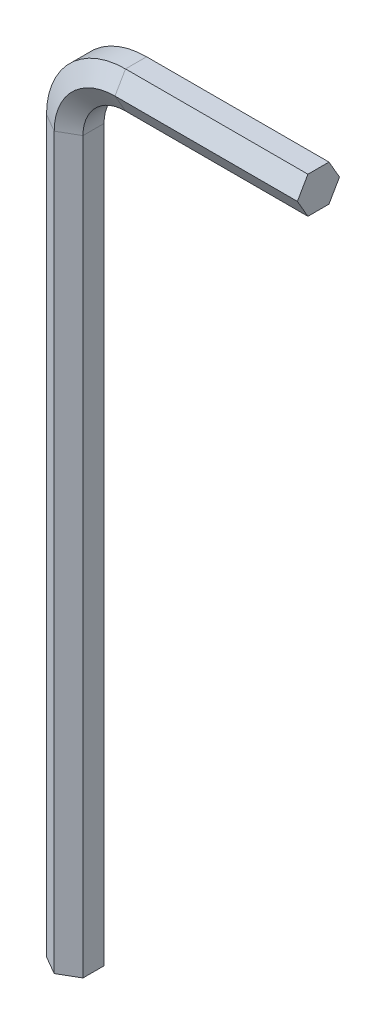
ISO-10303-21;
HEADER;
FILE_DESCRIPTION(('STEP AP214'),'2;1');
FILE_NAME('part.step','',(''),(''),'','','');
FILE_SCHEMA(('AUTOMOTIVE_DESIGN { 1 0 10303 214 1 1 1 1 }'));
ENDSEC;
DATA;
#1=APPLICATION_CONTEXT('core data for automotive mechanical design processes');
#2=APPLICATION_PROTOCOL_DEFINITION('international standard','automotive_design',2000,#1);
#3=PRODUCT_CONTEXT('',#1,'mechanical');
#4=PRODUCT('Part','Part','',(#3));
#5=PRODUCT_RELATED_PRODUCT_CATEGORY('part','',(#4));
#6=PRODUCT_DEFINITION_FORMATION('','',#4);
#7=PRODUCT_DEFINITION_CONTEXT('part definition',#1,'design');
#8=PRODUCT_DEFINITION('design','',#6,#7);
#9=PRODUCT_DEFINITION_SHAPE('','',#8);
#10=(LENGTH_UNIT() NAMED_UNIT(*) SI_UNIT(.MILLI.,.METRE.));
#11=(NAMED_UNIT(*) PLANE_ANGLE_UNIT() SI_UNIT($,.RADIAN.));
#12=(NAMED_UNIT(*) SI_UNIT($,.STERADIAN.) SOLID_ANGLE_UNIT());
#13=UNCERTAINTY_MEASURE_WITH_UNIT(LENGTH_MEASURE(1.E-05),#10,'distance_accuracy_value','');
#14=(GEOMETRIC_REPRESENTATION_CONTEXT(3) GLOBAL_UNCERTAINTY_ASSIGNED_CONTEXT((#13)) GLOBAL_UNIT_ASSIGNED_CONTEXT((#10,
#11,#12)) REPRESENTATION_CONTEXT('',''));
#15=CARTESIAN_POINT('',(0.,0.,0.));
#16=DIRECTION('',(0.,0.,1.));
#17=DIRECTION('',(1.,0.,0.));
#18=AXIS2_PLACEMENT_3D('',#15,#16,#17);
#19=CARTESIAN_POINT('',(0.,0.,0.));
#20=DIRECTION('',(0.,1.,0.));
#21=DIRECTION('',(0.,0.,1.));
#22=AXIS2_PLACEMENT_3D('',#19,#20,#21);
#23=PLANE('',#22);
#24=DIRECTION('',(0.,0.,-1.));
#25=VECTOR('',#24,1.);
#26=CARTESIAN_POINT('',(1.5,0.,0.866025403784438));
#27=LINE('',#26,#25);
#28=CARTESIAN_POINT('',(1.5,0.,0.866025403784438));
#29=VERTEX_POINT('',#28);
#30=CARTESIAN_POINT('',(1.5,0.,-0.866025403784439));
#31=VERTEX_POINT('',#30);
#32=EDGE_CURVE('E184',#29,#31,#27,.T.);
#33=ORIENTED_EDGE('',*,*,#32,.F.);
#34=DIRECTION('',(0.866025403784439,0.,-0.5));
#35=VECTOR('',#34,1.);
#36=CARTESIAN_POINT('',(0.,0.,1.73205080756888));
#37=LINE('',#36,#35);
#38=CARTESIAN_POINT('',(0.,0.,1.73205080756888));
#39=VERTEX_POINT('',#38);
#40=EDGE_CURVE('E226',#39,#29,#37,.T.);
#41=ORIENTED_EDGE('',*,*,#40,.F.);
#42=DIRECTION('',(0.866025403784439,0.,0.5));
#43=VECTOR('',#42,1.);
#44=CARTESIAN_POINT('',(-1.5,0.,0.866025403784438));
#45=LINE('',#44,#43);
#46=CARTESIAN_POINT('',(-1.5,0.,0.866025403784438));
#47=VERTEX_POINT('',#46);
#48=EDGE_CURVE('E213',#47,#39,#45,.T.);
#49=ORIENTED_EDGE('',*,*,#48,.F.);
#50=DIRECTION('',(0.,0.,1.));
#51=VECTOR('',#50,1.);
#52=CARTESIAN_POINT('',(-1.5,0.,-0.866025403784439));
#53=LINE('',#52,#51);
#54=CARTESIAN_POINT('',(-1.5,0.,-0.866025403784439));
#55=VERTEX_POINT('',#54);
#56=EDGE_CURVE('E136',#55,#47,#53,.T.);
#57=ORIENTED_EDGE('',*,*,#56,.F.);
#58=DIRECTION('',(-0.866025403784439,0.,0.5));
#59=VECTOR('',#58,1.);
#60=CARTESIAN_POINT('',(0.,0.,-1.73205080756888));
#61=LINE('',#60,#59);
#62=CARTESIAN_POINT('',(0.,0.,-1.73205080756888));
#63=VERTEX_POINT('',#62);
#64=EDGE_CURVE('E140',#63,#55,#61,.T.);
#65=ORIENTED_EDGE('',*,*,#64,.F.);
#66=DIRECTION('',(-0.866025403784439,0.,-0.5));
#67=VECTOR('',#66,1.);
#68=CARTESIAN_POINT('',(1.5,0.,-0.866025403784439));
#69=LINE('',#68,#67);
#70=EDGE_CURVE('E145',#31,#63,#69,.T.);
#71=ORIENTED_EDGE('',*,*,#70,.F.);
#72=EDGE_LOOP('',(#33,#41,#49,#57,#65,#71));
#73=FACE_BOUND('',#72,.T.);
#74=ADVANCED_FACE('F35',(#73),#23,.F.);
#75=CARTESIAN_POINT('',(20.,65.,0.));
#76=DIRECTION('',(1.,0.,0.));
#77=DIRECTION('',(0.,0.,1.));
#78=AXIS2_PLACEMENT_3D('',#75,#76,#77);
#79=PLANE('',#78);
#80=DIRECTION('',(0.,0.,-1.));
#81=VECTOR('',#80,1.);
#82=CARTESIAN_POINT('',(20.,63.5,0.866025403784438));
#83=LINE('',#82,#81);
#84=CARTESIAN_POINT('',(20.,63.5,0.866025403784438));
#85=VERTEX_POINT('',#84);
#86=CARTESIAN_POINT('',(20.,63.5,-0.866025403784439));
#87=VERTEX_POINT('',#86);
#88=EDGE_CURVE('E156',#85,#87,#83,.T.);
#89=ORIENTED_EDGE('',*,*,#88,.T.);
#90=DIRECTION('',(0.,0.866025403784439,-0.5));
#91=VECTOR('',#90,1.);
#92=CARTESIAN_POINT('',(20.,63.5,-0.866025403784439));
#93=LINE('',#92,#91);
#94=CARTESIAN_POINT('',(20.,65.,-1.73205080756888));
#95=VERTEX_POINT('',#94);
#96=EDGE_CURVE('E159',#87,#95,#93,.T.);
#97=ORIENTED_EDGE('',*,*,#96,.T.);
#98=DIRECTION('',(0.,0.866025403784439,0.5));
#99=VECTOR('',#98,1.);
#100=CARTESIAN_POINT('',(20.,65.,-1.73205080756888));
#101=LINE('',#100,#99);
#102=CARTESIAN_POINT('',(20.,66.5,-0.866025403784439));
#103=VERTEX_POINT('',#102);
#104=EDGE_CURVE('E199',#95,#103,#101,.T.);
#105=ORIENTED_EDGE('',*,*,#104,.T.);
#106=DIRECTION('',(0.,0.,1.));
#107=VECTOR('',#106,1.);
#108=CARTESIAN_POINT('',(20.,66.5,-0.866025403784439));
#109=LINE('',#108,#107);
#110=CARTESIAN_POINT('',(20.,66.5,0.866025403784438));
#111=VERTEX_POINT('',#110);
#112=EDGE_CURVE('E54',#103,#111,#109,.T.);
#113=ORIENTED_EDGE('',*,*,#112,.T.);
#114=DIRECTION('',(0.,-0.866025403784439,0.5));
#115=VECTOR('',#114,1.);
#116=CARTESIAN_POINT('',(20.,66.5,0.866025403784438));
#117=LINE('',#116,#115);
#118=CARTESIAN_POINT('',(20.,65.,1.73205080756888));
#119=VERTEX_POINT('',#118);
#120=EDGE_CURVE('E48',#111,#119,#117,.T.);
#121=ORIENTED_EDGE('',*,*,#120,.T.);
#122=DIRECTION('',(0.,-0.866025403784439,-0.5));
#123=VECTOR('',#122,1.);
#124=CARTESIAN_POINT('',(20.,65.,1.73205080756888));
#125=LINE('',#124,#123);
#126=EDGE_CURVE('E11',#119,#85,#125,.T.);
#127=ORIENTED_EDGE('',*,*,#126,.T.);
#128=EDGE_LOOP('',(#89,#97,#105,#113,#121,#127));
#129=FACE_BOUND('',#128,.T.);
#130=ADVANCED_FACE('F158',(#129),#79,.T.);
#131=CARTESIAN_POINT('',(1.5,0.,0.866025403784438));
#132=DIRECTION('',(1.,0.,0.));
#133=DIRECTION('',(0.,0.,-1.));
#134=AXIS2_PLACEMENT_3D('',#131,#132,#133);
#135=PLANE('',#134);
#136=DIRECTION('',(0.,1.,0.));
#137=VECTOR('',#136,1.);
#138=CARTESIAN_POINT('',(1.5,0.,-0.866025403784439));
#139=LINE('',#138,#137);
#140=CARTESIAN_POINT('',(1.5,60.,-0.866025403784439));
#141=VERTEX_POINT('',#140);
#142=EDGE_CURVE('E189',#31,#141,#139,.T.);
#143=ORIENTED_EDGE('',*,*,#142,.T.);
#144=DIRECTION('',(0.,0.,-1.));
#145=VECTOR('',#144,1.);
#146=CARTESIAN_POINT('',(1.5,60.,0.866025403784438));
#147=LINE('',#146,#145);
#148=CARTESIAN_POINT('',(1.5,60.,0.866025403784438));
#149=VERTEX_POINT('',#148);
#150=EDGE_CURVE('E258',#149,#141,#147,.T.);
#151=ORIENTED_EDGE('',*,*,#150,.F.);
#152=DIRECTION('',(0.,1.,0.));
#153=VECTOR('',#152,1.);
#154=CARTESIAN_POINT('',(1.5,0.,0.866025403784438));
#155=LINE('',#154,#153);
#156=EDGE_CURVE('E240',#29,#149,#155,.T.);
#157=ORIENTED_EDGE('',*,*,#156,.F.);
#158=ORIENTED_EDGE('',*,*,#32,.T.);
#159=EDGE_LOOP('',(#143,#151,#157,#158));
#160=FACE_BOUND('',#159,.T.);
#161=ADVANCED_FACE('F265',(#160),#135,.T.);
#162=CARTESIAN_POINT('',(1.5,0.,-0.866025403784439));
#163=DIRECTION('',(0.5,0.,-0.866025403784439));
#164=DIRECTION('',(-0.866025403784439,0.,-0.5));
#165=AXIS2_PLACEMENT_3D('',#162,#163,#164);
#166=PLANE('',#165);
#167=DIRECTION('',(0.,1.,0.));
#168=VECTOR('',#167,1.);
#169=CARTESIAN_POINT('',(0.,0.,-1.73205080756888));
#170=LINE('',#169,#168);
#171=CARTESIAN_POINT('',(0.,60.,-1.73205080756888));
#172=VERTEX_POINT('',#171);
#173=EDGE_CURVE('E188',#63,#172,#170,.T.);
#174=ORIENTED_EDGE('',*,*,#173,.T.);
#175=DIRECTION('',(-0.866025403784439,0.,-0.5));
#176=VECTOR('',#175,1.);
#177=CARTESIAN_POINT('',(1.5,60.,-0.866025403784439));
#178=LINE('',#177,#176);
#179=EDGE_CURVE('E185',#141,#172,#178,.T.);
#180=ORIENTED_EDGE('',*,*,#179,.F.);
#181=ORIENTED_EDGE('',*,*,#142,.F.);
#182=ORIENTED_EDGE('',*,*,#70,.T.);
#183=EDGE_LOOP('',(#174,#180,#181,#182));
#184=FACE_BOUND('',#183,.T.);
#185=ADVANCED_FACE('F268',(#184),#166,.T.);
#186=CARTESIAN_POINT('',(0.,0.,-1.73205080756888));
#187=DIRECTION('',(-0.5,0.,-0.866025403784439));
#188=DIRECTION('',(-0.866025403784439,0.,0.5));
#189=AXIS2_PLACEMENT_3D('',#186,#187,#188);
#190=PLANE('',#189);
#191=DIRECTION('',(0.,1.,0.));
#192=VECTOR('',#191,1.);
#193=CARTESIAN_POINT('',(-1.5,0.,-0.866025403784439));
#194=LINE('',#193,#192);
#195=CARTESIAN_POINT('',(-1.5,60.,-0.866025403784439));
#196=VERTEX_POINT('',#195);
#197=EDGE_CURVE('E202',#55,#196,#194,.T.);
#198=ORIENTED_EDGE('',*,*,#197,.T.);
#199=DIRECTION('',(-0.866025403784439,0.,0.5));
#200=VECTOR('',#199,1.);
#201=CARTESIAN_POINT('',(0.,60.,-1.73205080756888));
#202=LINE('',#201,#200);
#203=EDGE_CURVE('E192',#172,#196,#202,.T.);
#204=ORIENTED_EDGE('',*,*,#203,.F.);
#205=ORIENTED_EDGE('',*,*,#173,.F.);
#206=ORIENTED_EDGE('',*,*,#64,.T.);
#207=EDGE_LOOP('',(#198,#204,#205,#206));
#208=FACE_BOUND('',#207,.T.);
#209=ADVANCED_FACE('F322',(#208),#190,.T.);
#210=CARTESIAN_POINT('',(-1.5,0.,-0.866025403784439));
#211=DIRECTION('',(-1.,0.,0.));
#212=DIRECTION('',(0.,0.,1.));
#213=AXIS2_PLACEMENT_3D('',#210,#211,#212);
#214=PLANE('',#213);
#215=DIRECTION('',(0.,1.,0.));
#216=VECTOR('',#215,1.);
#217=CARTESIAN_POINT('',(-1.5,0.,0.866025403784438));
#218=LINE('',#217,#216);
#219=CARTESIAN_POINT('',(-1.5,60.,0.866025403784438));
#220=VERTEX_POINT('',#219);
#221=EDGE_CURVE('E215',#47,#220,#218,.T.);
#222=ORIENTED_EDGE('',*,*,#221,.T.);
#223=DIRECTION('',(0.,0.,1.));
#224=VECTOR('',#223,1.);
#225=CARTESIAN_POINT('',(-1.5,60.,-0.866025403784439));
#226=LINE('',#225,#224);
#227=EDGE_CURVE('E205',#196,#220,#226,.T.);
#228=ORIENTED_EDGE('',*,*,#227,.F.);
#229=ORIENTED_EDGE('',*,*,#197,.F.);
#230=ORIENTED_EDGE('',*,*,#56,.T.);
#231=EDGE_LOOP('',(#222,#228,#229,#230));
#232=FACE_BOUND('',#231,.T.);
#233=ADVANCED_FACE('F330',(#232),#214,.T.);
#234=CARTESIAN_POINT('',(-1.5,0.,0.866025403784438));
#235=DIRECTION('',(-0.5,0.,0.866025403784439));
#236=DIRECTION('',(0.866025403784439,0.,0.5));
#237=AXIS2_PLACEMENT_3D('',#234,#235,#236);
#238=PLANE('',#237);
#239=DIRECTION('',(0.,1.,0.));
#240=VECTOR('',#239,1.);
#241=CARTESIAN_POINT('',(0.,0.,1.73205080756888));
#242=LINE('',#241,#240);
#243=CARTESIAN_POINT('',(0.,60.,1.73205080756888));
#244=VERTEX_POINT('',#243);
#245=EDGE_CURVE('E228',#39,#244,#242,.T.);
#246=ORIENTED_EDGE('',*,*,#245,.T.);
#247=DIRECTION('',(0.866025403784439,0.,0.5));
#248=VECTOR('',#247,1.);
#249=CARTESIAN_POINT('',(-1.5,60.,0.866025403784438));
#250=LINE('',#249,#248);
#251=EDGE_CURVE('E218',#220,#244,#250,.T.);
#252=ORIENTED_EDGE('',*,*,#251,.F.);
#253=ORIENTED_EDGE('',*,*,#221,.F.);
#254=ORIENTED_EDGE('',*,*,#48,.T.);
#255=EDGE_LOOP('',(#246,#252,#253,#254));
#256=FACE_BOUND('',#255,.T.);
#257=ADVANCED_FACE('F340',(#256),#238,.T.);
#258=CARTESIAN_POINT('',(0.,0.,1.73205080756888));
#259=DIRECTION('',(0.5,0.,0.866025403784439));
#260=DIRECTION('',(0.866025403784439,0.,-0.5));
#261=AXIS2_PLACEMENT_3D('',#258,#259,#260);
#262=PLANE('',#261);
#263=DIRECTION('',(0.866025403784439,0.,-0.5));
#264=VECTOR('',#263,1.);
#265=CARTESIAN_POINT('',(0.,60.,1.73205080756888));
#266=LINE('',#265,#264);
#267=EDGE_CURVE('E231',#244,#149,#266,.T.);
#268=ORIENTED_EDGE('',*,*,#267,.F.);
#269=ORIENTED_EDGE('',*,*,#245,.F.);
#270=ORIENTED_EDGE('',*,*,#40,.T.);
#271=ORIENTED_EDGE('',*,*,#156,.T.);
#272=EDGE_LOOP('',(#268,#269,#270,#271));
#273=FACE_BOUND('',#272,.T.);
#274=ADVANCED_FACE('F281',(#273),#262,.T.);
#275=CARTESIAN_POINT('',(5.,60.,0.));
#276=DIRECTION('',(0.,0.,-1.));
#277=DIRECTION('',(-1.,0.,0.));
#278=AXIS2_PLACEMENT_3D('',#275,#276,#277);
#279=CYLINDRICAL_SURFACE('',#278,3.5);
#280=CARTESIAN_POINT('',(5.,60.,-0.866025403784439));
#281=DIRECTION('',(0.,0.,-1.));
#282=DIRECTION('',(-1.,0.,0.));
#283=AXIS2_PLACEMENT_3D('',#280,#281,#282);
#284=CIRCLE('',#283,3.5);
#285=CARTESIAN_POINT('',(5.,63.5,-0.866025403784439));
#286=VERTEX_POINT('',#285);
#287=EDGE_CURVE('E195',#141,#286,#284,.T.);
#288=ORIENTED_EDGE('',*,*,#287,.T.);
#289=DIRECTION('',(0.,0.,-1.));
#290=VECTOR('',#289,1.);
#291=CARTESIAN_POINT('',(5.,63.5,0.866025403784438));
#292=LINE('',#291,#290);
#293=CARTESIAN_POINT('',(5.,63.5,0.866025403784438));
#294=VERTEX_POINT('',#293);
#295=EDGE_CURVE('E177',#294,#286,#292,.T.);
#296=ORIENTED_EDGE('',*,*,#295,.F.);
#297=CARTESIAN_POINT('',(5.,60.,0.866025403784438));
#298=DIRECTION('',(0.,0.,-1.));
#299=DIRECTION('',(-1.,0.,0.));
#300=AXIS2_PLACEMENT_3D('',#297,#298,#299);
#301=CIRCLE('',#300,3.5);
#302=EDGE_CURVE('E242',#149,#294,#301,.T.);
#303=ORIENTED_EDGE('',*,*,#302,.F.);
#304=ORIENTED_EDGE('',*,*,#150,.T.);
#305=EDGE_LOOP('',(#288,#296,#303,#304));
#306=FACE_BOUND('',#305,.T.);
#307=ADVANCED_FACE('F248',(#306),#279,.F.);
#308=CARTESIAN_POINT('',(5.,60.,-0.866025403784439));
#309=DIRECTION('',(0.,0.,-1.));
#310=DIRECTION('',(-1.,0.,0.));
#311=AXIS2_PLACEMENT_3D('',#308,#309,#310);
#312=CONICAL_SURFACE('',#311,3.5,1.0471975511966);
#313=CARTESIAN_POINT('',(5.,60.,-1.73205080756888));
#314=DIRECTION('',(0.,0.,-1.));
#315=DIRECTION('',(-1.,0.,0.));
#316=AXIS2_PLACEMENT_3D('',#313,#314,#315);
#317=CIRCLE('',#316,5.);
#318=CARTESIAN_POINT('',(5.,65.,-1.73205080756888));
#319=VERTEX_POINT('',#318);
#320=EDGE_CURVE('E123',#172,#319,#317,.T.);
#321=ORIENTED_EDGE('',*,*,#320,.T.);
#322=DIRECTION('',(0.,0.866025403784439,-0.5));
#323=VECTOR('',#322,1.);
#324=CARTESIAN_POINT('',(5.,63.5,-0.866025403784439));
#325=LINE('',#324,#323);
#326=EDGE_CURVE('E193',#286,#319,#325,.T.);
#327=ORIENTED_EDGE('',*,*,#326,.F.);
#328=ORIENTED_EDGE('',*,*,#287,.F.);
#329=ORIENTED_EDGE('',*,*,#179,.T.);
#330=EDGE_LOOP('',(#321,#327,#328,#329));
#331=FACE_BOUND('',#330,.T.);
#332=ADVANCED_FACE('F271',(#331),#312,.F.);
#333=CARTESIAN_POINT('',(5.,60.,-1.73205080756888));
#334=DIRECTION('',(0.,0.,1.));
#335=DIRECTION('',(1.,0.,0.));
#336=AXIS2_PLACEMENT_3D('',#333,#334,#335);
#337=CONICAL_SURFACE('',#336,5.,1.0471975511966);
#338=CARTESIAN_POINT('',(5.,60.,-0.866025403784439));
#339=DIRECTION('',(0.,0.,-1.));
#340=DIRECTION('',(-1.,0.,0.));
#341=AXIS2_PLACEMENT_3D('',#338,#339,#340);
#342=CIRCLE('',#341,6.5);
#343=CARTESIAN_POINT('',(5.,66.5,-0.866025403784439));
#344=VERTEX_POINT('',#343);
#345=EDGE_CURVE('E114',#196,#344,#342,.T.);
#346=ORIENTED_EDGE('',*,*,#345,.T.);
#347=DIRECTION('',(0.,0.866025403784439,0.5));
#348=VECTOR('',#347,1.);
#349=CARTESIAN_POINT('',(5.,65.,-1.73205080756888));
#350=LINE('',#349,#348);
#351=EDGE_CURVE('E196',#319,#344,#350,.T.);
#352=ORIENTED_EDGE('',*,*,#351,.F.);
#353=ORIENTED_EDGE('',*,*,#320,.F.);
#354=ORIENTED_EDGE('',*,*,#203,.T.);
#355=EDGE_LOOP('',(#346,#352,#353,#354));
#356=FACE_BOUND('',#355,.T.);
#357=ADVANCED_FACE('F273',(#356),#337,.T.);
#358=CARTESIAN_POINT('',(5.,60.,0.));
#359=DIRECTION('',(0.,0.,-1.));
#360=DIRECTION('',(-1.,0.,0.));
#361=AXIS2_PLACEMENT_3D('',#358,#359,#360);
#362=CYLINDRICAL_SURFACE('',#361,6.5);
#363=CARTESIAN_POINT('',(5.,60.,0.866025403784438));
#364=DIRECTION('',(0.,0.,-1.));
#365=DIRECTION('',(-1.,0.,0.));
#366=AXIS2_PLACEMENT_3D('',#363,#364,#365);
#367=CIRCLE('',#366,6.5);
#368=CARTESIAN_POINT('',(5.,66.5,0.866025403784438));
#369=VERTEX_POINT('',#368);
#370=EDGE_CURVE('E107',#220,#369,#367,.T.);
#371=ORIENTED_EDGE('',*,*,#370,.T.);
#372=DIRECTION('',(0.,0.,1.));
#373=VECTOR('',#372,1.);
#374=CARTESIAN_POINT('',(5.,66.5,-0.866025403784439));
#375=LINE('',#374,#373);
#376=EDGE_CURVE('E209',#344,#369,#375,.T.);
#377=ORIENTED_EDGE('',*,*,#376,.F.);
#378=ORIENTED_EDGE('',*,*,#345,.F.);
#379=ORIENTED_EDGE('',*,*,#227,.T.);
#380=EDGE_LOOP('',(#371,#377,#378,#379));
#381=FACE_BOUND('',#380,.T.);
#382=ADVANCED_FACE('F279',(#381),#362,.T.);
#383=CARTESIAN_POINT('',(5.,60.,0.866025403784438));
#384=DIRECTION('',(0.,0.,-1.));
#385=DIRECTION('',(-1.,0.,0.));
#386=AXIS2_PLACEMENT_3D('',#383,#384,#385);
#387=CONICAL_SURFACE('',#386,6.5,1.0471975511966);
#388=CARTESIAN_POINT('',(5.,60.,1.73205080756888));
#389=DIRECTION('',(0.,0.,-1.));
#390=DIRECTION('',(-1.,0.,0.));
#391=AXIS2_PLACEMENT_3D('',#388,#389,#390);
#392=CIRCLE('',#391,5.);
#393=CARTESIAN_POINT('',(5.,65.,1.73205080756888));
#394=VERTEX_POINT('',#393);
#395=EDGE_CURVE('E233',#244,#394,#392,.T.);
#396=ORIENTED_EDGE('',*,*,#395,.T.);
#397=DIRECTION('',(0.,-0.866025403784439,0.5));
#398=VECTOR('',#397,1.);
#399=CARTESIAN_POINT('',(5.,66.5,0.866025403784438));
#400=LINE('',#399,#398);
#401=EDGE_CURVE('E221',#369,#394,#400,.T.);
#402=ORIENTED_EDGE('',*,*,#401,.F.);
#403=ORIENTED_EDGE('',*,*,#370,.F.);
#404=ORIENTED_EDGE('',*,*,#251,.T.);
#405=EDGE_LOOP('',(#396,#402,#403,#404));
#406=FACE_BOUND('',#405,.T.);
#407=ADVANCED_FACE('F383',(#406),#387,.T.);
#408=CARTESIAN_POINT('',(5.,60.,1.73205080756888));
#409=DIRECTION('',(0.,0.,1.));
#410=DIRECTION('',(1.,0.,0.));
#411=AXIS2_PLACEMENT_3D('',#408,#409,#410);
#412=CONICAL_SURFACE('',#411,5.,1.0471975511966);
#413=DIRECTION('',(0.,-0.866025403784439,-0.5));
#414=VECTOR('',#413,1.);
#415=CARTESIAN_POINT('',(5.,65.,1.73205080756888));
#416=LINE('',#415,#414);
#417=EDGE_CURVE('E182',#394,#294,#416,.T.);
#418=ORIENTED_EDGE('',*,*,#417,.F.);
#419=ORIENTED_EDGE('',*,*,#395,.F.);
#420=ORIENTED_EDGE('',*,*,#267,.T.);
#421=ORIENTED_EDGE('',*,*,#302,.T.);
#422=EDGE_LOOP('',(#418,#419,#420,#421));
#423=FACE_BOUND('',#422,.T.);
#424=ADVANCED_FACE('F251',(#423),#412,.F.);
#425=CARTESIAN_POINT('',(5.,63.5,0.866025403784438));
#426=DIRECTION('',(0.,-1.,0.));
#427=DIRECTION('',(0.,0.,-1.));
#428=AXIS2_PLACEMENT_3D('',#425,#426,#427);
#429=PLANE('',#428);
#430=DIRECTION('',(1.,0.,0.));
#431=VECTOR('',#430,1.);
#432=CARTESIAN_POINT('',(5.,63.5,-0.866025403784439));
#433=LINE('',#432,#431);
#434=EDGE_CURVE('E164',#286,#87,#433,.T.);
#435=ORIENTED_EDGE('',*,*,#434,.T.);
#436=ORIENTED_EDGE('',*,*,#88,.F.);
#437=DIRECTION('',(1.,0.,0.));
#438=VECTOR('',#437,1.);
#439=CARTESIAN_POINT('',(5.,63.5,0.866025403784438));
#440=LINE('',#439,#438);
#441=EDGE_CURVE('E165',#294,#85,#440,.T.);
#442=ORIENTED_EDGE('',*,*,#441,.F.);
#443=ORIENTED_EDGE('',*,*,#295,.T.);
#444=EDGE_LOOP('',(#435,#436,#442,#443));
#445=FACE_BOUND('',#444,.T.);
#446=ADVANCED_FACE('F175',(#445),#429,.T.);
#447=CARTESIAN_POINT('',(5.,63.5,-0.866025403784439));
#448=DIRECTION('',(0.,-0.5,-0.866025403784439));
#449=DIRECTION('',(0.,0.866025403784439,-0.5));
#450=AXIS2_PLACEMENT_3D('',#447,#448,#449);
#451=PLANE('',#450);
#452=DIRECTION('',(1.,0.,0.));
#453=VECTOR('',#452,1.);
#454=CARTESIAN_POINT('',(5.,65.,-1.73205080756888));
#455=LINE('',#454,#453);
#456=EDGE_CURVE('E172',#319,#95,#455,.T.);
#457=ORIENTED_EDGE('',*,*,#456,.T.);
#458=ORIENTED_EDGE('',*,*,#96,.F.);
#459=ORIENTED_EDGE('',*,*,#434,.F.);
#460=ORIENTED_EDGE('',*,*,#326,.T.);
#461=EDGE_LOOP('',(#457,#458,#459,#460));
#462=FACE_BOUND('',#461,.T.);
#463=ADVANCED_FACE('F169',(#462),#451,.T.);
#464=CARTESIAN_POINT('',(5.,65.,-1.73205080756888));
#465=DIRECTION('',(0.,0.5,-0.866025403784439));
#466=DIRECTION('',(0.,0.866025403784439,0.5));
#467=AXIS2_PLACEMENT_3D('',#464,#465,#466);
#468=PLANE('',#467);
#469=DIRECTION('',(1.,0.,0.));
#470=VECTOR('',#469,1.);
#471=CARTESIAN_POINT('',(5.,66.5,-0.866025403784439));
#472=LINE('',#471,#470);
#473=EDGE_CURVE('E92',#344,#103,#472,.T.);
#474=ORIENTED_EDGE('',*,*,#473,.T.);
#475=ORIENTED_EDGE('',*,*,#104,.F.);
#476=ORIENTED_EDGE('',*,*,#456,.F.);
#477=ORIENTED_EDGE('',*,*,#351,.T.);
#478=EDGE_LOOP('',(#474,#475,#476,#477));
#479=FACE_BOUND('',#478,.T.);
#480=ADVANCED_FACE('F415',(#479),#468,.T.);
#481=CARTESIAN_POINT('',(5.,66.5,-0.866025403784439));
#482=DIRECTION('',(0.,1.,0.));
#483=DIRECTION('',(0.,0.,1.));
#484=AXIS2_PLACEMENT_3D('',#481,#482,#483);
#485=PLANE('',#484);
#486=DIRECTION('',(1.,0.,0.));
#487=VECTOR('',#486,1.);
#488=CARTESIAN_POINT('',(5.,66.5,0.866025403784438));
#489=LINE('',#488,#487);
#490=EDGE_CURVE('E84',#369,#111,#489,.T.);
#491=ORIENTED_EDGE('',*,*,#490,.T.);
#492=ORIENTED_EDGE('',*,*,#112,.F.);
#493=ORIENTED_EDGE('',*,*,#473,.F.);
#494=ORIENTED_EDGE('',*,*,#376,.T.);
#495=EDGE_LOOP('',(#491,#492,#493,#494));
#496=FACE_BOUND('',#495,.T.);
#497=ADVANCED_FACE('F291',(#496),#485,.T.);
#498=CARTESIAN_POINT('',(5.,66.5,0.866025403784438));
#499=DIRECTION('',(0.,0.5,0.866025403784439));
#500=DIRECTION('',(0.,-0.866025403784439,0.5));
#501=AXIS2_PLACEMENT_3D('',#498,#499,#500);
#502=PLANE('',#501);
#503=DIRECTION('',(1.,0.,0.));
#504=VECTOR('',#503,1.);
#505=CARTESIAN_POINT('',(5.,65.,1.73205080756888));
#506=LINE('',#505,#504);
#507=EDGE_CURVE('E42',#394,#119,#506,.T.);
#508=ORIENTED_EDGE('',*,*,#507,.T.);
#509=ORIENTED_EDGE('',*,*,#120,.F.);
#510=ORIENTED_EDGE('',*,*,#490,.F.);
#511=ORIENTED_EDGE('',*,*,#401,.T.);
#512=EDGE_LOOP('',(#508,#509,#510,#511));
#513=FACE_BOUND('',#512,.T.);
#514=ADVANCED_FACE('F286',(#513),#502,.T.);
#515=CARTESIAN_POINT('',(5.,65.,1.73205080756888));
#516=DIRECTION('',(0.,-0.5,0.866025403784439));
#517=DIRECTION('',(0.,-0.866025403784439,-0.5));
#518=AXIS2_PLACEMENT_3D('',#515,#516,#517);
#519=PLANE('',#518);
#520=ORIENTED_EDGE('',*,*,#126,.F.);
#521=ORIENTED_EDGE('',*,*,#507,.F.);
#522=ORIENTED_EDGE('',*,*,#417,.T.);
#523=ORIENTED_EDGE('',*,*,#441,.T.);
#524=EDGE_LOOP('',(#520,#521,#522,#523));
#525=FACE_BOUND('',#524,.T.);
#526=ADVANCED_FACE('F243',(#525),#519,.T.);
#527=CLOSED_SHELL('',(#74,#130,#161,#185,#209,#233,#257,#274,#307,#332,#357,#382,#407,#424,#446,
#463,#480,#497,#514,#526));
#528=MANIFOLD_SOLID_BREP('B2',#527);
#529=ADVANCED_BREP_SHAPE_REPRESENTATION('',(#18,#528),#14);
#530=SHAPE_DEFINITION_REPRESENTATION(#9,#529);
ENDSEC;
END-ISO-10303-21;
